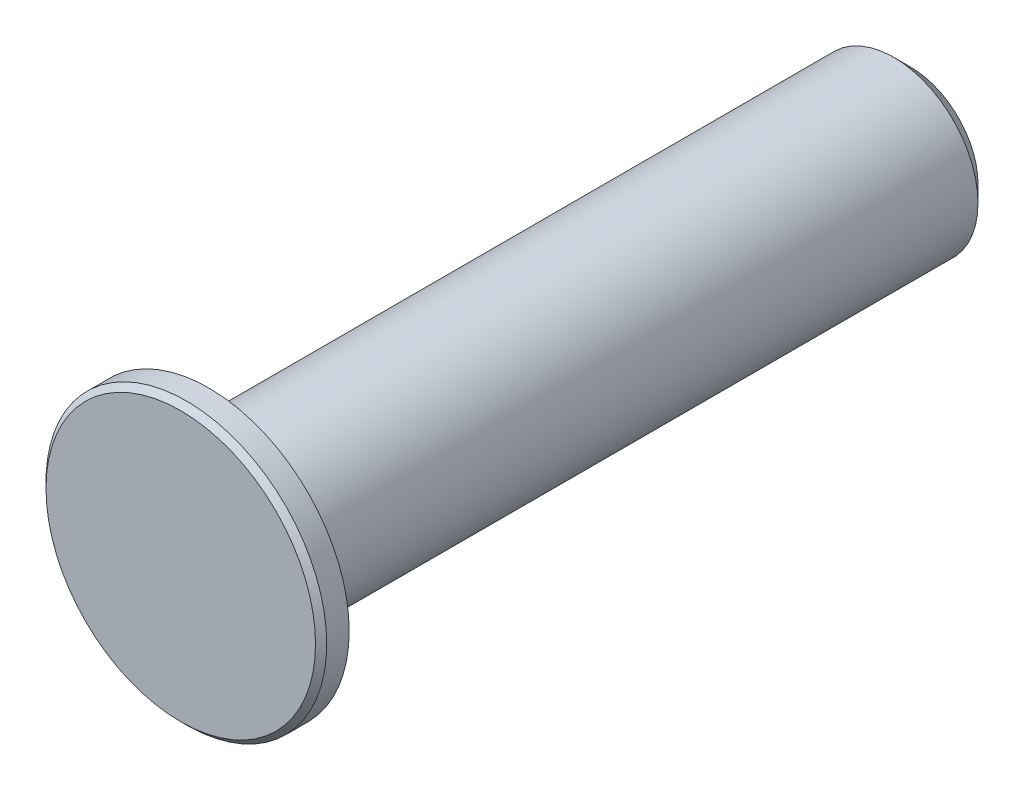
ISO-10303-21;
HEADER;
FILE_DESCRIPTION(('STEP AP214'),'2;1');
FILE_NAME('part.step','',(''),(''),'','','');
FILE_SCHEMA(('AUTOMOTIVE_DESIGN { 1 0 10303 214 1 1 1 1 }'));
ENDSEC;
DATA;
#1=APPLICATION_CONTEXT('core data for automotive mechanical design processes');
#2=APPLICATION_PROTOCOL_DEFINITION('international standard','automotive_design',2000,#1);
#3=PRODUCT_CONTEXT('',#1,'mechanical');
#4=PRODUCT('Part','Part','',(#3));
#5=PRODUCT_RELATED_PRODUCT_CATEGORY('part','',(#4));
#6=PRODUCT_DEFINITION_FORMATION('','',#4);
#7=PRODUCT_DEFINITION_CONTEXT('part definition',#1,'design');
#8=PRODUCT_DEFINITION('design','',#6,#7);
#9=PRODUCT_DEFINITION_SHAPE('','',#8);
#10=(LENGTH_UNIT() NAMED_UNIT(*) SI_UNIT(.MILLI.,.METRE.));
#11=(NAMED_UNIT(*) PLANE_ANGLE_UNIT() SI_UNIT($,.RADIAN.));
#12=(NAMED_UNIT(*) SI_UNIT($,.STERADIAN.) SOLID_ANGLE_UNIT());
#13=UNCERTAINTY_MEASURE_WITH_UNIT(LENGTH_MEASURE(1.E-05),#10,'distance_accuracy_value','');
#14=(GEOMETRIC_REPRESENTATION_CONTEXT(3) GLOBAL_UNCERTAINTY_ASSIGNED_CONTEXT((#13)) GLOBAL_UNIT_ASSIGNED_CONTEXT((#10,
#11,#12)) REPRESENTATION_CONTEXT('',''));
#15=CARTESIAN_POINT('',(0.,0.,0.));
#16=DIRECTION('',(0.,0.,1.));
#17=DIRECTION('',(1.,0.,0.));
#18=AXIS2_PLACEMENT_3D('',#15,#16,#17);
#19=CARTESIAN_POINT('',(0.,0.,25.));
#20=DIRECTION('',(0.,0.,-1.));
#21=DIRECTION('',(-1.,0.,0.));
#22=AXIS2_PLACEMENT_3D('',#19,#20,#21);
#23=CYLINDRICAL_SURFACE('',#22,3.);
#24=CARTESIAN_POINT('',(0.,0.,0.600000000000003));
#25=DIRECTION('',(0.,0.,1.));
#26=DIRECTION('',(1.,0.,0.));
#27=AXIS2_PLACEMENT_3D('',#24,#25,#26);
#28=CIRCLE('',#27,3.);
#29=CARTESIAN_POINT('',(3.,0.,0.600000000000003));
#30=VERTEX_POINT('',#29);
#31=EDGE_CURVE('E55',#30,#30,#28,.T.);
#32=ORIENTED_EDGE('',*,*,#31,.T.);
#33=EDGE_LOOP('',(#32));
#34=FACE_BOUND('',#33,.T.);
#35=CARTESIAN_POINT('',(0.,0.,25.));
#36=DIRECTION('',(0.,0.,1.));
#37=DIRECTION('',(1.,0.,0.));
#38=AXIS2_PLACEMENT_3D('',#35,#36,#37);
#39=CIRCLE('',#38,3.);
#40=CARTESIAN_POINT('',(3.,0.,25.));
#41=VERTEX_POINT('',#40);
#42=EDGE_CURVE('E61',#41,#41,#39,.T.);
#43=ORIENTED_EDGE('',*,*,#42,.F.);
#44=EDGE_LOOP('',(#43));
#45=FACE_BOUND('',#44,.T.);
#46=ADVANCED_FACE('F37',(#34,#45),#23,.T.);
#47=CARTESIAN_POINT('',(0.,0.,0.));
#48=DIRECTION('',(0.,0.,1.));
#49=DIRECTION('',(1.,0.,0.));
#50=AXIS2_PLACEMENT_3D('',#47,#48,#49);
#51=PLANE('',#50);
#52=CARTESIAN_POINT('',(0.,0.,0.));
#53=DIRECTION('',(0.,0.,1.));
#54=DIRECTION('',(1.,0.,0.));
#55=AXIS2_PLACEMENT_3D('',#52,#53,#54);
#56=CIRCLE('',#55,2.39999999999999);
#57=CARTESIAN_POINT('',(2.39999999999999,0.,0.));
#58=VERTEX_POINT('',#57);
#59=EDGE_CURVE('E50',#58,#58,#56,.F.);
#60=ORIENTED_EDGE('',*,*,#59,.T.);
#61=EDGE_LOOP('',(#60));
#62=FACE_BOUND('',#61,.T.);
#63=ADVANCED_FACE('F86',(#62),#51,.F.);
#64=CARTESIAN_POINT('',(0.,0.,26.));
#65=DIRECTION('',(0.,0.,-1.));
#66=DIRECTION('',(-1.,0.,0.));
#67=AXIS2_PLACEMENT_3D('',#64,#65,#66);
#68=CYLINDRICAL_SURFACE('',#67,5.);
#69=CARTESIAN_POINT('',(0.,0.,25.8));
#70=DIRECTION('',(0.,0.,1.));
#71=DIRECTION('',(1.,0.,0.));
#72=AXIS2_PLACEMENT_3D('',#69,#70,#71);
#73=CIRCLE('',#72,5.);
#74=CARTESIAN_POINT('',(5.,0.,25.8));
#75=VERTEX_POINT('',#74);
#76=EDGE_CURVE('E10',#75,#75,#73,.F.);
#77=ORIENTED_EDGE('',*,*,#76,.T.);
#78=EDGE_LOOP('',(#77));
#79=FACE_BOUND('',#78,.T.);
#80=CARTESIAN_POINT('',(0.,0.,25.));
#81=DIRECTION('',(0.,0.,1.));
#82=DIRECTION('',(1.,0.,0.));
#83=AXIS2_PLACEMENT_3D('',#80,#81,#82);
#84=CIRCLE('',#83,5.);
#85=CARTESIAN_POINT('',(5.,0.,25.));
#86=VERTEX_POINT('',#85);
#87=EDGE_CURVE('E65',#86,#86,#84,.T.);
#88=ORIENTED_EDGE('',*,*,#87,.T.);
#89=EDGE_LOOP('',(#88));
#90=FACE_BOUND('',#89,.T.);
#91=ADVANCED_FACE('F70',(#79,#90),#68,.T.);
#92=CARTESIAN_POINT('',(0.,0.,26.));
#93=DIRECTION('',(0.,0.,1.));
#94=DIRECTION('',(1.,0.,0.));
#95=AXIS2_PLACEMENT_3D('',#92,#93,#94);
#96=PLANE('',#95);
#97=CARTESIAN_POINT('',(0.,0.,26.));
#98=DIRECTION('',(0.,0.,1.));
#99=DIRECTION('',(1.,0.,0.));
#100=AXIS2_PLACEMENT_3D('',#97,#98,#99);
#101=CIRCLE('',#100,4.8);
#102=CARTESIAN_POINT('',(4.8,0.,26.));
#103=VERTEX_POINT('',#102);
#104=EDGE_CURVE('E45',#103,#103,#101,.T.);
#105=ORIENTED_EDGE('',*,*,#104,.T.);
#106=EDGE_LOOP('',(#105));
#107=FACE_BOUND('',#106,.T.);
#108=ADVANCED_FACE('F75',(#107),#96,.T.);
#109=CARTESIAN_POINT('',(0.,0.,25.));
#110=DIRECTION('',(0.,0.,1.));
#111=DIRECTION('',(1.,0.,0.));
#112=AXIS2_PLACEMENT_3D('',#109,#110,#111);
#113=PLANE('',#112);
#114=ORIENTED_EDGE('',*,*,#42,.T.);
#115=EDGE_LOOP('',(#114));
#116=FACE_BOUND('',#115,.T.);
#117=ORIENTED_EDGE('',*,*,#87,.F.);
#118=EDGE_LOOP('',(#117));
#119=FACE_BOUND('',#118,.T.);
#120=ADVANCED_FACE('F72',(#116,#119),#113,.F.);
#121=CARTESIAN_POINT('',(0.,0.,0.600000000000003));
#122=DIRECTION('',(0.,0.,1.));
#123=DIRECTION('',(1.,0.,0.));
#124=AXIS2_PLACEMENT_3D('',#121,#122,#123);
#125=CONICAL_SURFACE('',#124,3.,0.785398163397451);
#126=ORIENTED_EDGE('',*,*,#59,.F.);
#127=EDGE_LOOP('',(#126));
#128=FACE_BOUND('',#127,.T.);
#129=ORIENTED_EDGE('',*,*,#31,.F.);
#130=EDGE_LOOP('',(#129));
#131=FACE_BOUND('',#130,.T.);
#132=ADVANCED_FACE('F74',(#128,#131),#125,.T.);
#133=CARTESIAN_POINT('',(0.,0.,26.));
#134=DIRECTION('',(0.,0.,-1.));
#135=DIRECTION('',(-1.,0.,0.));
#136=AXIS2_PLACEMENT_3D('',#133,#134,#135);
#137=CONICAL_SURFACE('',#136,4.8,0.785398163397455);
#138=ORIENTED_EDGE('',*,*,#76,.F.);
#139=EDGE_LOOP('',(#138));
#140=FACE_BOUND('',#139,.T.);
#141=ORIENTED_EDGE('',*,*,#104,.F.);
#142=EDGE_LOOP('',(#141));
#143=FACE_BOUND('',#142,.T.);
#144=ADVANCED_FACE('F39',(#140,#143),#137,.T.);
#145=CLOSED_SHELL('',(#46,#63,#91,#108,#120,#132,#144));
#146=MANIFOLD_SOLID_BREP('B2',#145);
#147=ADVANCED_BREP_SHAPE_REPRESENTATION('',(#18,#146),#14);
#148=SHAPE_DEFINITION_REPRESENTATION(#9,#147);
ENDSEC;
END-ISO-10303-21;
